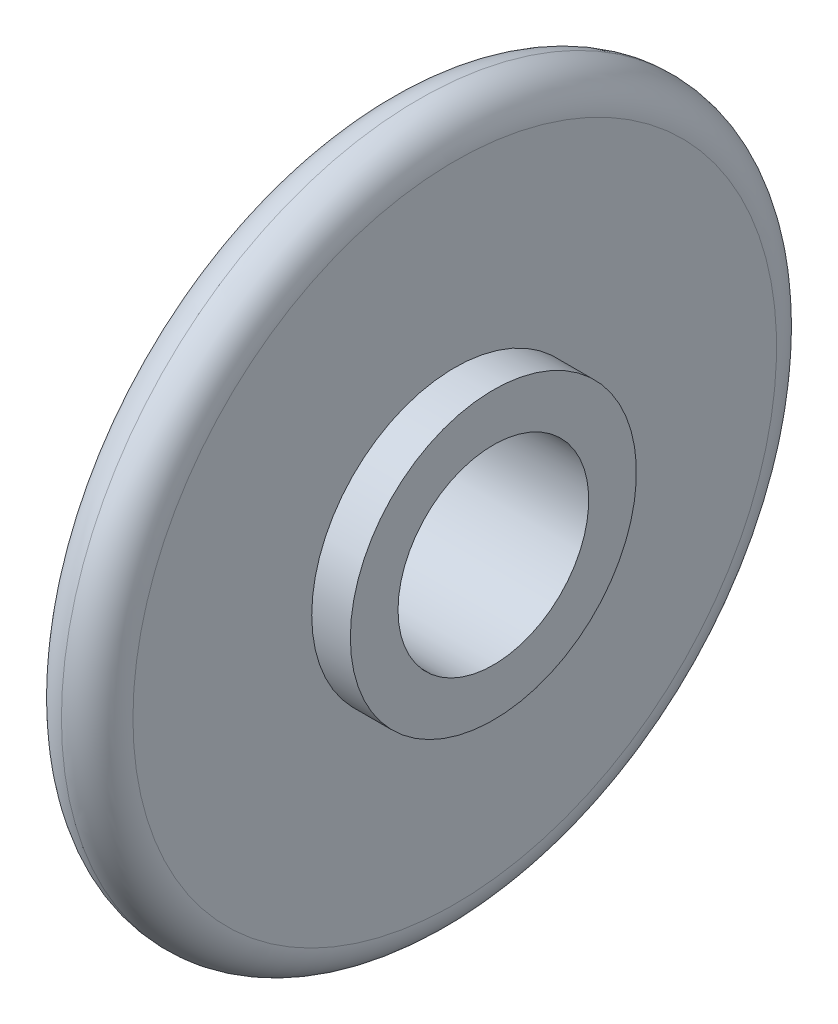
ISO-10303-21;
HEADER;
FILE_DESCRIPTION(('STEP AP214'),'2;1');
FILE_NAME('part.step','',(''),(''),'','','');
FILE_SCHEMA(('AUTOMOTIVE_DESIGN { 1 0 10303 214 1 1 1 1 }'));
ENDSEC;
DATA;
#1=APPLICATION_CONTEXT('core data for automotive mechanical design processes');
#2=APPLICATION_PROTOCOL_DEFINITION('international standard','automotive_design',2000,#1);
#3=PRODUCT_CONTEXT('',#1,'mechanical');
#4=PRODUCT('Part','Part','',(#3));
#5=PRODUCT_RELATED_PRODUCT_CATEGORY('part','',(#4));
#6=PRODUCT_DEFINITION_FORMATION('','',#4);
#7=PRODUCT_DEFINITION_CONTEXT('part definition',#1,'design');
#8=PRODUCT_DEFINITION('design','',#6,#7);
#9=PRODUCT_DEFINITION_SHAPE('','',#8);
#10=(LENGTH_UNIT() NAMED_UNIT(*) SI_UNIT(.MILLI.,.METRE.));
#11=(NAMED_UNIT(*) PLANE_ANGLE_UNIT() SI_UNIT($,.RADIAN.));
#12=(NAMED_UNIT(*) SI_UNIT($,.STERADIAN.) SOLID_ANGLE_UNIT());
#13=UNCERTAINTY_MEASURE_WITH_UNIT(LENGTH_MEASURE(1.E-05),#10,'distance_accuracy_value','');
#14=(GEOMETRIC_REPRESENTATION_CONTEXT(3) GLOBAL_UNCERTAINTY_ASSIGNED_CONTEXT((#13)) GLOBAL_UNIT_ASSIGNED_CONTEXT((#10,
#11,#12)) REPRESENTATION_CONTEXT('',''));
#15=CARTESIAN_POINT('',(0.,0.,0.));
#16=DIRECTION('',(0.,0.,1.));
#17=DIRECTION('',(1.,0.,0.));
#18=AXIS2_PLACEMENT_3D('',#15,#16,#17);
#19=CARTESIAN_POINT('',(-12.1550604060913,6.,0.));
#20=DIRECTION('',(1.,0.,0.));
#21=DIRECTION('',(0.,0.,-1.));
#22=AXIS2_PLACEMENT_3D('',#19,#20,#21);
#23=PLANE('',#22);
#24=CARTESIAN_POINT('',(-12.1550604060913,0.,0.));
#25=DIRECTION('',(-1.,0.,0.));
#26=DIRECTION('',(0.,0.,1.));
#27=AXIS2_PLACEMENT_3D('',#24,#25,#26);
#28=CIRCLE('',#27,4.);
#29=CARTESIAN_POINT('',(-12.1550604060913,0.,4.));
#30=VERTEX_POINT('',#29);
#31=EDGE_CURVE('E42',#30,#30,#28,.T.);
#32=ORIENTED_EDGE('',*,*,#31,.F.);
#33=EDGE_LOOP('',(#32));
#34=FACE_BOUND('',#33,.T.);
#35=CARTESIAN_POINT('',(-12.1550604060914,0.,0.));
#36=DIRECTION('',(-1.,0.,0.));
#37=DIRECTION('',(0.,0.,1.));
#38=AXIS2_PLACEMENT_3D('',#35,#36,#37);
#39=CIRCLE('',#38,6.);
#40=CARTESIAN_POINT('',(-12.1550604060914,0.,6.));
#41=VERTEX_POINT('',#40);
#42=EDGE_CURVE('E59',#41,#41,#39,.T.);
#43=ORIENTED_EDGE('',*,*,#42,.T.);
#44=EDGE_LOOP('',(#43));
#45=FACE_BOUND('',#44,.T.);
#46=ADVANCED_FACE('F30',(#34,#45),#23,.F.);
#47=CARTESIAN_POINT('',(-24.3316742808799,0.,0.));
#48=DIRECTION('',(-1.,0.,0.));
#49=DIRECTION('',(0.,0.,1.));
#50=AXIS2_PLACEMENT_3D('',#47,#48,#49);
#51=CYLINDRICAL_SURFACE('',#50,4.);
#52=CARTESIAN_POINT('',(-5.91506040609135,0.,0.));
#53=DIRECTION('',(-1.,0.,0.));
#54=DIRECTION('',(0.,0.,1.));
#55=AXIS2_PLACEMENT_3D('',#52,#53,#54);
#56=CIRCLE('',#55,4.);
#57=CARTESIAN_POINT('',(-5.91506040609135,0.,4.));
#58=VERTEX_POINT('',#57);
#59=EDGE_CURVE('E47',#58,#58,#56,.T.);
#60=ORIENTED_EDGE('',*,*,#59,.F.);
#61=EDGE_LOOP('',(#60));
#62=FACE_BOUND('',#61,.T.);
#63=ORIENTED_EDGE('',*,*,#31,.T.);
#64=EDGE_LOOP('',(#63));
#65=FACE_BOUND('',#64,.T.);
#66=ADVANCED_FACE('F80',(#62,#65),#51,.F.);
#67=CARTESIAN_POINT('',(-5.91506040609135,4.,0.));
#68=DIRECTION('',(-1.,0.,0.));
#69=DIRECTION('',(0.,0.,1.));
#70=AXIS2_PLACEMENT_3D('',#67,#68,#69);
#71=PLANE('',#70);
#72=CARTESIAN_POINT('',(-5.91506040609135,0.,0.));
#73=DIRECTION('',(-1.,0.,0.));
#74=DIRECTION('',(0.,0.,1.));
#75=AXIS2_PLACEMENT_3D('',#72,#73,#74);
#76=CIRCLE('',#75,6.);
#77=CARTESIAN_POINT('',(-5.91506040609135,0.,6.));
#78=VERTEX_POINT('',#77);
#79=EDGE_CURVE('E50',#78,#78,#76,.T.);
#80=ORIENTED_EDGE('',*,*,#79,.F.);
#81=EDGE_LOOP('',(#80));
#82=FACE_BOUND('',#81,.T.);
#83=ORIENTED_EDGE('',*,*,#59,.T.);
#84=EDGE_LOOP('',(#83));
#85=FACE_BOUND('',#84,.T.);
#86=ADVANCED_FACE('F86',(#82,#85),#71,.F.);
#87=CARTESIAN_POINT('',(-24.3316742808799,0.,0.));
#88=DIRECTION('',(-1.,0.,0.));
#89=DIRECTION('',(0.,0.,1.));
#90=AXIS2_PLACEMENT_3D('',#87,#88,#89);
#91=CYLINDRICAL_SURFACE('',#90,6.);
#92=CARTESIAN_POINT('',(-7.53506040609135,0.,0.));
#93=DIRECTION('',(-1.,0.,0.));
#94=DIRECTION('',(0.,0.,1.));
#95=AXIS2_PLACEMENT_3D('',#92,#93,#94);
#96=CIRCLE('',#95,6.);
#97=CARTESIAN_POINT('',(-7.53506040609135,0.,6.));
#98=VERTEX_POINT('',#97);
#99=EDGE_CURVE('E53',#98,#98,#96,.T.);
#100=ORIENTED_EDGE('',*,*,#99,.F.);
#101=EDGE_LOOP('',(#100));
#102=FACE_BOUND('',#101,.T.);
#103=ORIENTED_EDGE('',*,*,#79,.T.);
#104=EDGE_LOOP('',(#103));
#105=FACE_BOUND('',#104,.T.);
#106=ADVANCED_FACE('F93',(#102,#105),#91,.T.);
#107=CARTESIAN_POINT('',(-7.53506040609135,6.,0.));
#108=DIRECTION('',(-1.,0.,0.));
#109=DIRECTION('',(0.,0.,1.));
#110=AXIS2_PLACEMENT_3D('',#107,#108,#109);
#111=PLANE('',#110);
#112=CARTESIAN_POINT('',(-7.53506040609135,0.,0.));
#113=DIRECTION('',(-1.,0.,0.));
#114=DIRECTION('',(0.,0.,1.));
#115=AXIS2_PLACEMENT_3D('',#112,#113,#114);
#116=CIRCLE('',#115,13.5);
#117=CARTESIAN_POINT('',(-7.53506040609135,0.,13.5));
#118=VERTEX_POINT('',#117);
#119=EDGE_CURVE('E38',#118,#118,#116,.F.);
#120=ORIENTED_EDGE('',*,*,#119,.T.);
#121=EDGE_LOOP('',(#120));
#122=FACE_BOUND('',#121,.T.);
#123=ORIENTED_EDGE('',*,*,#99,.T.);
#124=EDGE_LOOP('',(#123));
#125=FACE_BOUND('',#124,.T.);
#126=ADVANCED_FACE('F97',(#122,#125),#111,.F.);
#127=CARTESIAN_POINT('',(-10.5350604060914,15.,0.));
#128=DIRECTION('',(1.,0.,0.));
#129=DIRECTION('',(0.,0.,-1.));
#130=AXIS2_PLACEMENT_3D('',#127,#128,#129);
#131=PLANE('',#130);
#132=CARTESIAN_POINT('',(-10.5350604060914,0.,0.));
#133=DIRECTION('',(1.,0.,0.));
#134=DIRECTION('',(0.,0.,-1.));
#135=AXIS2_PLACEMENT_3D('',#132,#133,#134);
#136=CIRCLE('',#135,13.5);
#137=CARTESIAN_POINT('',(-10.5350604060914,0.,-13.5));
#138=VERTEX_POINT('',#137);
#139=EDGE_CURVE('E10',#138,#138,#136,.F.);
#140=ORIENTED_EDGE('',*,*,#139,.T.);
#141=EDGE_LOOP('',(#140));
#142=FACE_BOUND('',#141,.T.);
#143=CARTESIAN_POINT('',(-10.5350604060914,0.,0.));
#144=DIRECTION('',(-1.,0.,0.));
#145=DIRECTION('',(0.,0.,1.));
#146=AXIS2_PLACEMENT_3D('',#143,#144,#145);
#147=CIRCLE('',#146,6.);
#148=CARTESIAN_POINT('',(-10.5350604060914,0.,6.));
#149=VERTEX_POINT('',#148);
#150=EDGE_CURVE('E56',#149,#149,#147,.T.);
#151=ORIENTED_EDGE('',*,*,#150,.F.);
#152=EDGE_LOOP('',(#151));
#153=FACE_BOUND('',#152,.T.);
#154=ADVANCED_FACE('F76',(#142,#153),#131,.F.);
#155=CARTESIAN_POINT('',(-24.3316742808799,0.,0.));
#156=DIRECTION('',(-1.,0.,0.));
#157=DIRECTION('',(0.,0.,1.));
#158=AXIS2_PLACEMENT_3D('',#155,#156,#157);
#159=CYLINDRICAL_SURFACE('',#158,6.);
#160=ORIENTED_EDGE('',*,*,#42,.F.);
#161=EDGE_LOOP('',(#160));
#162=FACE_BOUND('',#161,.T.);
#163=ORIENTED_EDGE('',*,*,#150,.T.);
#164=EDGE_LOOP('',(#163));
#165=FACE_BOUND('',#164,.T.);
#166=ADVANCED_FACE('F69',(#162,#165),#159,.T.);
#167=CARTESIAN_POINT('',(-9.03506040609135,0.,0.));
#168=DIRECTION('',(1.,0.,0.));
#169=DIRECTION('',(0.,0.,-1.));
#170=AXIS2_PLACEMENT_3D('',#167,#168,#169);
#171=TOROIDAL_SURFACE('',#170,13.5,1.5);
#172=ORIENTED_EDGE('',*,*,#139,.F.);
#173=EDGE_LOOP('',(#172));
#174=FACE_BOUND('',#173,.T.);
#175=CARTESIAN_POINT('',(-9.03506040609135,0.,0.));
#176=DIRECTION('',(1.,0.,0.));
#177=DIRECTION('',(0.,0.,-1.));
#178=AXIS2_PLACEMENT_3D('',#175,#176,#177);
#179=CIRCLE('',#178,15.);
#180=CARTESIAN_POINT('',(-9.03506040609135,0.,-15.));
#181=VERTEX_POINT('',#180);
#182=EDGE_CURVE('E34',#181,#181,#179,.T.);
#183=ORIENTED_EDGE('',*,*,#182,.F.);
#184=EDGE_LOOP('',(#183));
#185=FACE_BOUND('',#184,.T.);
#186=ADVANCED_FACE('F32',(#174,#185),#171,.T.);
#187=CARTESIAN_POINT('',(-9.03506040609135,0.,0.));
#188=DIRECTION('',(-1.,0.,0.));
#189=DIRECTION('',(0.,0.,1.));
#190=AXIS2_PLACEMENT_3D('',#187,#188,#189);
#191=TOROIDAL_SURFACE('',#190,13.5,1.5);
#192=ORIENTED_EDGE('',*,*,#119,.F.);
#193=EDGE_LOOP('',(#192));
#194=FACE_BOUND('',#193,.T.);
#195=ORIENTED_EDGE('',*,*,#182,.T.);
#196=EDGE_LOOP('',(#195));
#197=FACE_BOUND('',#196,.T.);
#198=ADVANCED_FACE('F66',(#194,#197),#191,.T.);
#199=CLOSED_SHELL('',(#46,#66,#86,#106,#126,#154,#166,#186,#198));
#200=MANIFOLD_SOLID_BREP('B2',#199);
#201=ADVANCED_BREP_SHAPE_REPRESENTATION('',(#18,#200),#14);
#202=SHAPE_DEFINITION_REPRESENTATION(#9,#201);
ENDSEC;
END-ISO-10303-21;
